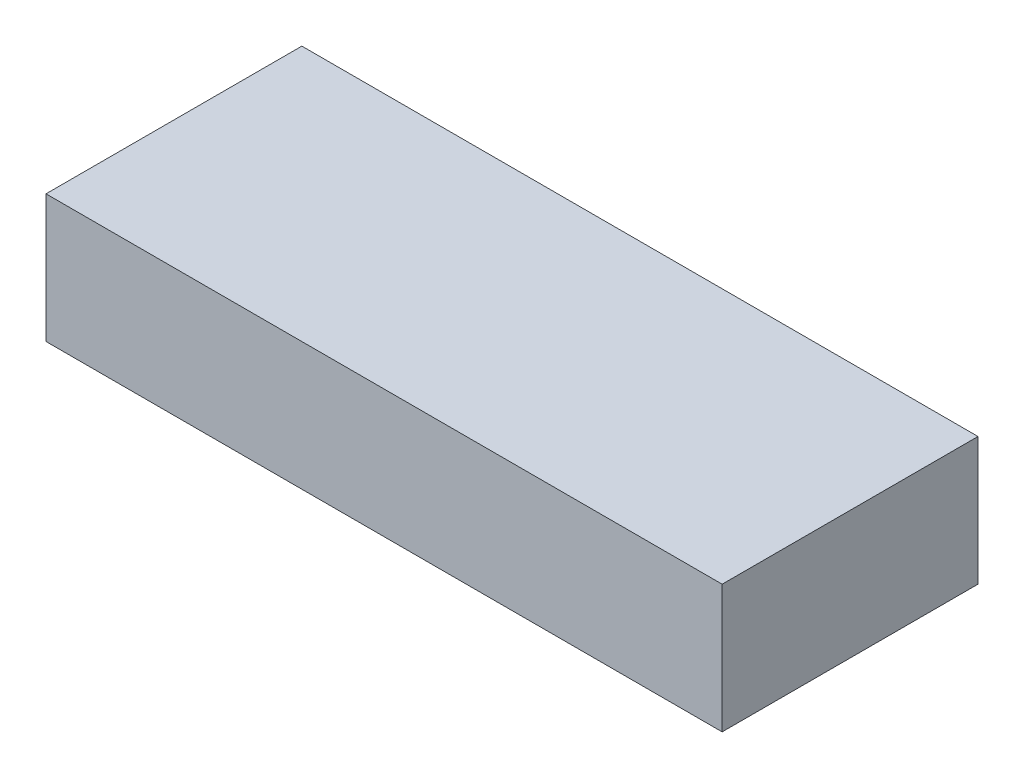
ISO-10303-21;
HEADER;
FILE_DESCRIPTION(('STEP AP214'),'2;1');
FILE_NAME('part.step','',(''),(''),'','','');
FILE_SCHEMA(('AUTOMOTIVE_DESIGN { 1 0 10303 214 1 1 1 1 }'));
ENDSEC;
DATA;
#1=APPLICATION_CONTEXT('core data for automotive mechanical design processes');
#2=APPLICATION_PROTOCOL_DEFINITION('international standard','automotive_design',2000,#1);
#3=PRODUCT_CONTEXT('',#1,'mechanical');
#4=PRODUCT('Part','Part','',(#3));
#5=PRODUCT_RELATED_PRODUCT_CATEGORY('part','',(#4));
#6=PRODUCT_DEFINITION_FORMATION('','',#4);
#7=PRODUCT_DEFINITION_CONTEXT('part definition',#1,'design');
#8=PRODUCT_DEFINITION('design','',#6,#7);
#9=PRODUCT_DEFINITION_SHAPE('','',#8);
#10=(LENGTH_UNIT() NAMED_UNIT(*) SI_UNIT(.MILLI.,.METRE.));
#11=(NAMED_UNIT(*) PLANE_ANGLE_UNIT() SI_UNIT($,.RADIAN.));
#12=(NAMED_UNIT(*) SI_UNIT($,.STERADIAN.) SOLID_ANGLE_UNIT());
#13=UNCERTAINTY_MEASURE_WITH_UNIT(LENGTH_MEASURE(1.E-05),#10,'distance_accuracy_value','');
#14=(GEOMETRIC_REPRESENTATION_CONTEXT(3) GLOBAL_UNCERTAINTY_ASSIGNED_CONTEXT((#13)) GLOBAL_UNIT_ASSIGNED_CONTEXT((#10,
#11,#12)) REPRESENTATION_CONTEXT('',''));
#15=CARTESIAN_POINT('',(0.,0.,0.));
#16=DIRECTION('',(0.,0.,1.));
#17=DIRECTION('',(1.,0.,0.));
#18=AXIS2_PLACEMENT_3D('',#15,#16,#17);
#19=CARTESIAN_POINT('',(185.,35.,-70.));
#20=DIRECTION('',(-1.,0.,0.));
#21=DIRECTION('',(0.,0.,1.));
#22=AXIS2_PLACEMENT_3D('',#19,#20,#21);
#23=PLANE('',#22);
#24=DIRECTION('',(0.,0.,-1.));
#25=VECTOR('',#24,1.);
#26=CARTESIAN_POINT('',(185.,-35.,-70.));
#27=LINE('',#26,#25);
#28=CARTESIAN_POINT('',(185.,-35.,70.));
#29=VERTEX_POINT('',#28);
#30=CARTESIAN_POINT('',(185.,-35.,-70.));
#31=VERTEX_POINT('',#30);
#32=EDGE_CURVE('E96',#29,#31,#27,.T.);
#33=ORIENTED_EDGE('',*,*,#32,.T.);
#34=DIRECTION('',(0.,-1.,0.));
#35=VECTOR('',#34,1.);
#36=CARTESIAN_POINT('',(185.,35.,-70.));
#37=LINE('',#36,#35);
#38=CARTESIAN_POINT('',(185.,35.,-70.));
#39=VERTEX_POINT('',#38);
#40=EDGE_CURVE('E11',#39,#31,#37,.T.);
#41=ORIENTED_EDGE('',*,*,#40,.F.);
#42=DIRECTION('',(0.,0.,-1.));
#43=VECTOR('',#42,1.);
#44=CARTESIAN_POINT('',(185.,35.,-70.));
#45=LINE('',#44,#43);
#46=CARTESIAN_POINT('',(185.,35.,70.));
#47=VERTEX_POINT('',#46);
#48=EDGE_CURVE('E84',#47,#39,#45,.T.);
#49=ORIENTED_EDGE('',*,*,#48,.F.);
#50=DIRECTION('',(0.,-1.,0.));
#51=VECTOR('',#50,1.);
#52=CARTESIAN_POINT('',(185.,35.,70.));
#53=LINE('',#52,#51);
#54=EDGE_CURVE('E92',#47,#29,#53,.T.);
#55=ORIENTED_EDGE('',*,*,#54,.T.);
#56=EDGE_LOOP('',(#33,#41,#49,#55));
#57=FACE_BOUND('',#56,.T.);
#58=ADVANCED_FACE('F33',(#57),#23,.F.);
#59=CARTESIAN_POINT('',(-185.,35.,-70.));
#60=DIRECTION('',(0.,0.,1.));
#61=DIRECTION('',(1.,0.,0.));
#62=AXIS2_PLACEMENT_3D('',#59,#60,#61);
#63=PLANE('',#62);
#64=DIRECTION('',(-1.,0.,0.));
#65=VECTOR('',#64,1.);
#66=CARTESIAN_POINT('',(-185.,-35.,-70.));
#67=LINE('',#66,#65);
#68=CARTESIAN_POINT('',(-185.,-35.,-70.));
#69=VERTEX_POINT('',#68);
#70=EDGE_CURVE('E88',#31,#69,#67,.T.);
#71=ORIENTED_EDGE('',*,*,#70,.T.);
#72=DIRECTION('',(0.,-1.,0.));
#73=VECTOR('',#72,1.);
#74=CARTESIAN_POINT('',(-185.,35.,-70.));
#75=LINE('',#74,#73);
#76=CARTESIAN_POINT('',(-185.,35.,-70.));
#77=VERTEX_POINT('',#76);
#78=EDGE_CURVE('E41',#77,#69,#75,.T.);
#79=ORIENTED_EDGE('',*,*,#78,.F.);
#80=DIRECTION('',(-1.,0.,0.));
#81=VECTOR('',#80,1.);
#82=CARTESIAN_POINT('',(-185.,35.,-70.));
#83=LINE('',#82,#81);
#84=EDGE_CURVE('E79',#39,#77,#83,.T.);
#85=ORIENTED_EDGE('',*,*,#84,.F.);
#86=ORIENTED_EDGE('',*,*,#40,.T.);
#87=EDGE_LOOP('',(#71,#79,#85,#86));
#88=FACE_BOUND('',#87,.T.);
#89=ADVANCED_FACE('F87',(#88),#63,.F.);
#90=CARTESIAN_POINT('',(-185.,35.,-70.));
#91=DIRECTION('',(1.,0.,0.));
#92=DIRECTION('',(0.,0.,-1.));
#93=AXIS2_PLACEMENT_3D('',#90,#91,#92);
#94=PLANE('',#93);
#95=DIRECTION('',(0.,0.,1.));
#96=VECTOR('',#95,1.);
#97=CARTESIAN_POINT('',(-185.,-35.,-70.));
#98=LINE('',#97,#96);
#99=CARTESIAN_POINT('',(-185.,-35.,70.));
#100=VERTEX_POINT('',#99);
#101=EDGE_CURVE('E66',#69,#100,#98,.T.);
#102=ORIENTED_EDGE('',*,*,#101,.T.);
#103=DIRECTION('',(0.,-1.,0.));
#104=VECTOR('',#103,1.);
#105=CARTESIAN_POINT('',(-185.,35.,70.));
#106=LINE('',#105,#104);
#107=CARTESIAN_POINT('',(-185.,35.,70.));
#108=VERTEX_POINT('',#107);
#109=EDGE_CURVE('E89',#108,#100,#106,.T.);
#110=ORIENTED_EDGE('',*,*,#109,.F.);
#111=DIRECTION('',(0.,0.,1.));
#112=VECTOR('',#111,1.);
#113=CARTESIAN_POINT('',(-185.,35.,-70.));
#114=LINE('',#113,#112);
#115=EDGE_CURVE('E82',#77,#108,#114,.T.);
#116=ORIENTED_EDGE('',*,*,#115,.F.);
#117=ORIENTED_EDGE('',*,*,#78,.T.);
#118=EDGE_LOOP('',(#102,#110,#116,#117));
#119=FACE_BOUND('',#118,.T.);
#120=ADVANCED_FACE('F90',(#119),#94,.F.);
#121=CARTESIAN_POINT('',(-185.,35.,70.));
#122=DIRECTION('',(0.,0.,-1.));
#123=DIRECTION('',(-1.,0.,0.));
#124=AXIS2_PLACEMENT_3D('',#121,#122,#123);
#125=PLANE('',#124);
#126=DIRECTION('',(1.,0.,0.));
#127=VECTOR('',#126,1.);
#128=CARTESIAN_POINT('',(-185.,-35.,70.));
#129=LINE('',#128,#127);
#130=EDGE_CURVE('E72',#100,#29,#129,.T.);
#131=ORIENTED_EDGE('',*,*,#130,.T.);
#132=ORIENTED_EDGE('',*,*,#54,.F.);
#133=DIRECTION('',(1.,0.,0.));
#134=VECTOR('',#133,1.);
#135=CARTESIAN_POINT('',(-185.,35.,70.));
#136=LINE('',#135,#134);
#137=EDGE_CURVE('E49',#108,#47,#136,.T.);
#138=ORIENTED_EDGE('',*,*,#137,.F.);
#139=ORIENTED_EDGE('',*,*,#109,.T.);
#140=EDGE_LOOP('',(#131,#132,#138,#139));
#141=FACE_BOUND('',#140,.T.);
#142=ADVANCED_FACE('F103',(#141),#125,.F.);
#143=CARTESIAN_POINT('',(0.,35.,0.));
#144=DIRECTION('',(0.,1.,0.));
#145=DIRECTION('',(0.,0.,1.));
#146=AXIS2_PLACEMENT_3D('',#143,#144,#145);
#147=PLANE('',#146);
#148=ORIENTED_EDGE('',*,*,#48,.T.);
#149=ORIENTED_EDGE('',*,*,#84,.T.);
#150=ORIENTED_EDGE('',*,*,#115,.T.);
#151=ORIENTED_EDGE('',*,*,#137,.T.);
#152=EDGE_LOOP('',(#148,#149,#150,#151));
#153=FACE_BOUND('',#152,.T.);
#154=ADVANCED_FACE('F80',(#153),#147,.T.);
#155=CARTESIAN_POINT('',(0.,-35.,0.));
#156=DIRECTION('',(0.,1.,0.));
#157=DIRECTION('',(0.,0.,1.));
#158=AXIS2_PLACEMENT_3D('',#155,#156,#157);
#159=PLANE('',#158);
#160=ORIENTED_EDGE('',*,*,#32,.F.);
#161=ORIENTED_EDGE('',*,*,#130,.F.);
#162=ORIENTED_EDGE('',*,*,#101,.F.);
#163=ORIENTED_EDGE('',*,*,#70,.F.);
#164=EDGE_LOOP('',(#160,#161,#162,#163));
#165=FACE_BOUND('',#164,.T.);
#166=ADVANCED_FACE('F106',(#165),#159,.F.);
#167=CLOSED_SHELL('',(#58,#89,#120,#142,#154,#166));
#168=MANIFOLD_SOLID_BREP('B2',#167);
#169=ADVANCED_BREP_SHAPE_REPRESENTATION('',(#18,#168),#14);
#170=SHAPE_DEFINITION_REPRESENTATION(#9,#169);
ENDSEC;
END-ISO-10303-21;
